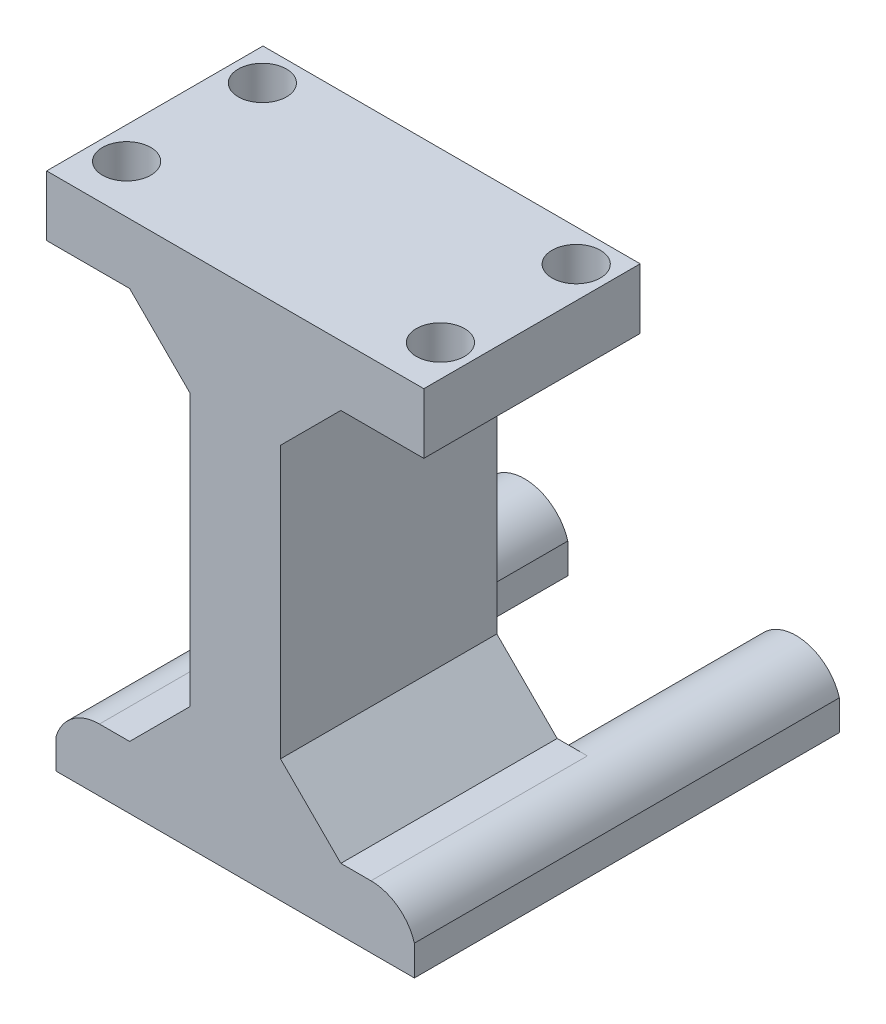
ISO-10303-21;
HEADER;
FILE_DESCRIPTION(('STEP AP214'),'2;1');
FILE_NAME('part.step','',(''),(''),'','','');
FILE_SCHEMA(('AUTOMOTIVE_DESIGN { 1 0 10303 214 1 1 1 1 }'));
ENDSEC;
DATA;
#1=APPLICATION_CONTEXT('core data for automotive mechanical design processes');
#2=APPLICATION_PROTOCOL_DEFINITION('international standard','automotive_design',2000,#1);
#3=PRODUCT_CONTEXT('',#1,'mechanical');
#4=PRODUCT('Part','Part','',(#3));
#5=PRODUCT_RELATED_PRODUCT_CATEGORY('part','',(#4));
#6=PRODUCT_DEFINITION_FORMATION('','',#4);
#7=PRODUCT_DEFINITION_CONTEXT('part definition',#1,'design');
#8=PRODUCT_DEFINITION('design','',#6,#7);
#9=PRODUCT_DEFINITION_SHAPE('','',#8);
#10=(LENGTH_UNIT() NAMED_UNIT(*) SI_UNIT(.MILLI.,.METRE.));
#11=(NAMED_UNIT(*) PLANE_ANGLE_UNIT() SI_UNIT($,.RADIAN.));
#12=(NAMED_UNIT(*) SI_UNIT($,.STERADIAN.) SOLID_ANGLE_UNIT());
#13=UNCERTAINTY_MEASURE_WITH_UNIT(LENGTH_MEASURE(1.E-05),#10,'distance_accuracy_value','');
#14=(GEOMETRIC_REPRESENTATION_CONTEXT(3) GLOBAL_UNCERTAINTY_ASSIGNED_CONTEXT((#13)) GLOBAL_UNIT_ASSIGNED_CONTEXT((#10,
#11,#12)) REPRESENTATION_CONTEXT('',''));
#15=CARTESIAN_POINT('',(0.,0.,0.));
#16=DIRECTION('',(0.,0.,1.));
#17=DIRECTION('',(1.,0.,0.));
#18=AXIS2_PLACEMENT_3D('',#15,#16,#17);
#19=CARTESIAN_POINT('',(0.,15.,-35.85));
#20=DIRECTION('',(0.,1.,0.));
#21=DIRECTION('',(0.,0.,1.));
#22=AXIS2_PLACEMENT_3D('',#19,#20,#21);
#23=PLANE('',#22);
#24=DIRECTION('',(-1.,0.,0.));
#25=VECTOR('',#24,1.);
#26=CARTESIAN_POINT('',(0.,15.,35.85));
#27=LINE('',#26,#25);
#28=CARTESIAN_POINT('',(10.0000000000001,15.,35.85));
#29=VERTEX_POINT('',#28);
#30=CARTESIAN_POINT('',(0.,15.,35.85));
#31=VERTEX_POINT('',#30);
#32=EDGE_CURVE('E318',#29,#31,#27,.T.);
#33=ORIENTED_EDGE('',*,*,#32,.F.);
#34=DIRECTION('',(0.,0.,-1.));
#35=VECTOR('',#34,1.);
#36=CARTESIAN_POINT('',(10.0000000000001,15.,-35.85));
#37=LINE('',#36,#35);
#38=CARTESIAN_POINT('',(10.0000000000001,15.,-35.85));
#39=VERTEX_POINT('',#38);
#40=EDGE_CURVE('E400',#29,#39,#37,.T.);
#41=ORIENTED_EDGE('',*,*,#40,.T.);
#42=DIRECTION('',(-1.,0.,0.));
#43=VECTOR('',#42,1.);
#44=CARTESIAN_POINT('',(0.,15.,-35.85));
#45=LINE('',#44,#43);
#46=CARTESIAN_POINT('',(0.,15.,-35.85));
#47=VERTEX_POINT('',#46);
#48=EDGE_CURVE('E297',#39,#47,#45,.T.);
#49=ORIENTED_EDGE('',*,*,#48,.T.);
#50=DIRECTION('',(0.,0.,1.));
#51=VECTOR('',#50,1.);
#52=CARTESIAN_POINT('',(0.,15.,-35.85));
#53=LINE('',#52,#51);
#54=EDGE_CURVE('E325',#47,#31,#53,.T.);
#55=ORIENTED_EDGE('',*,*,#54,.T.);
#56=EDGE_LOOP('',(#33,#41,#49,#55));
#57=FACE_BOUND('',#56,.T.);
#58=ADVANCED_FACE('F43',(#57),#23,.T.);
#59=CARTESIAN_POINT('',(90.,15.,-35.85));
#60=VERTEX_POINT('',#59);
#61=CARTESIAN_POINT('',(79.9999999999999,15.,-35.85));
#62=VERTEX_POINT('',#61);
#63=EDGE_CURVE('E299',#60,#62,#45,.T.);
#64=ORIENTED_EDGE('',*,*,#63,.T.);
#65=DIRECTION('',(0.,0.,1.));
#66=VECTOR('',#65,1.);
#67=CARTESIAN_POINT('',(79.9999999999999,15.,-35.85));
#68=LINE('',#67,#66);
#69=CARTESIAN_POINT('',(79.9999999999999,15.,35.85));
#70=VERTEX_POINT('',#69);
#71=EDGE_CURVE('E60',#62,#70,#68,.T.);
#72=ORIENTED_EDGE('',*,*,#71,.T.);
#73=CARTESIAN_POINT('',(90.,15.,35.85));
#74=VERTEX_POINT('',#73);
#75=EDGE_CURVE('E319',#74,#70,#27,.T.);
#76=ORIENTED_EDGE('',*,*,#75,.F.);
#77=DIRECTION('',(0.,0.,1.));
#78=VECTOR('',#77,1.);
#79=CARTESIAN_POINT('',(90.,15.,-35.85));
#80=LINE('',#79,#78);
#81=EDGE_CURVE('E330',#60,#74,#80,.T.);
#82=ORIENTED_EDGE('',*,*,#81,.F.);
#83=EDGE_LOOP('',(#64,#72,#76,#82));
#84=FACE_BOUND('',#83,.T.);
#85=ADVANCED_FACE('F488',(#84),#23,.T.);
#86=CARTESIAN_POINT('',(0.,0.,-105.));
#87=DIRECTION('',(0.,0.,1.));
#88=DIRECTION('',(1.,0.,0.));
#89=AXIS2_PLACEMENT_3D('',#86,#87,#88);
#90=CYLINDRICAL_SURFACE('',#89,15.);
#91=DIRECTION('',(0.,0.,1.));
#92=VECTOR('',#91,1.);
#93=CARTESIAN_POINT('',(-14.3747227124986,4.28571428571428,-105.));
#94=LINE('',#93,#92);
#95=CARTESIAN_POINT('',(-14.3747227124986,4.28571428571428,-105.));
#96=VERTEX_POINT('',#95);
#97=CARTESIAN_POINT('',(-14.3747227124986,4.28571428571428,35.85));
#98=VERTEX_POINT('',#97);
#99=EDGE_CURVE('E366',#96,#98,#94,.T.);
#100=ORIENTED_EDGE('',*,*,#99,.T.);
#101=CARTESIAN_POINT('',(0.,0.,35.85));
#102=DIRECTION('',(0.,0.,1.));
#103=DIRECTION('',(1.,0.,0.));
#104=AXIS2_PLACEMENT_3D('',#101,#102,#103);
#105=CIRCLE('',#104,15.);
#106=EDGE_CURVE('E298',#31,#98,#105,.T.);
#107=ORIENTED_EDGE('',*,*,#106,.F.);
#108=ORIENTED_EDGE('',*,*,#54,.F.);
#109=CARTESIAN_POINT('',(0.,0.,-35.85));
#110=DIRECTION('',(0.,0.,1.));
#111=DIRECTION('',(1.,0.,0.));
#112=AXIS2_PLACEMENT_3D('',#109,#110,#111);
#113=CIRCLE('',#112,15.);
#114=CARTESIAN_POINT('',(14.3747227124986,4.28571428571428,-35.85));
#115=VERTEX_POINT('',#114);
#116=EDGE_CURVE('E341',#47,#115,#113,.F.);
#117=ORIENTED_EDGE('',*,*,#116,.T.);
#118=DIRECTION('',(0.,0.,1.));
#119=VECTOR('',#118,1.);
#120=CARTESIAN_POINT('',(14.3747227124986,4.28571428571428,-105.));
#121=LINE('',#120,#119);
#122=CARTESIAN_POINT('',(14.3747227124986,4.28571428571428,-105.));
#123=VERTEX_POINT('',#122);
#124=EDGE_CURVE('E365',#123,#115,#121,.T.);
#125=ORIENTED_EDGE('',*,*,#124,.F.);
#126=CARTESIAN_POINT('',(0.,0.,-105.));
#127=DIRECTION('',(0.,0.,1.));
#128=DIRECTION('',(1.,0.,0.));
#129=AXIS2_PLACEMENT_3D('',#126,#127,#128);
#130=CIRCLE('',#129,15.);
#131=EDGE_CURVE('E361',#123,#96,#130,.T.);
#132=ORIENTED_EDGE('',*,*,#131,.T.);
#133=EDGE_LOOP('',(#100,#107,#108,#117,#125,#132));
#134=FACE_BOUND('',#133,.T.);
#135=ADVANCED_FACE('F435',(#134),#90,.T.);
#136=CARTESIAN_POINT('',(14.3747227124986,-5.71428571428572,-105.));
#137=DIRECTION('',(-1.,0.,0.));
#138=DIRECTION('',(0.,0.,1.));
#139=AXIS2_PLACEMENT_3D('',#136,#137,#138);
#140=PLANE('',#139);
#141=DIRECTION('',(0.,1.,0.));
#142=VECTOR('',#141,1.);
#143=CARTESIAN_POINT('',(14.3747227124986,-5.71428571428572,-35.85));
#144=LINE('',#143,#142);
#145=CARTESIAN_POINT('',(14.3747227124986,-5.71428571428572,-35.85));
#146=VERTEX_POINT('',#145);
#147=EDGE_CURVE('E329',#146,#115,#144,.T.);
#148=ORIENTED_EDGE('',*,*,#147,.F.);
#149=DIRECTION('',(0.,0.,1.));
#150=VECTOR('',#149,1.);
#151=CARTESIAN_POINT('',(14.3747227124986,-5.71428571428572,-105.));
#152=LINE('',#151,#150);
#153=CARTESIAN_POINT('',(14.3747227124986,-5.71428571428572,-105.));
#154=VERTEX_POINT('',#153);
#155=EDGE_CURVE('E351',#154,#146,#152,.T.);
#156=ORIENTED_EDGE('',*,*,#155,.F.);
#157=DIRECTION('',(0.,1.,0.));
#158=VECTOR('',#157,1.);
#159=CARTESIAN_POINT('',(14.3747227124986,-5.71428571428572,-105.));
#160=LINE('',#159,#158);
#161=EDGE_CURVE('E355',#154,#123,#160,.T.);
#162=ORIENTED_EDGE('',*,*,#161,.T.);
#163=ORIENTED_EDGE('',*,*,#124,.T.);
#164=EDGE_LOOP('',(#148,#156,#162,#163));
#165=FACE_BOUND('',#164,.T.);
#166=ADVANCED_FACE('F502',(#165),#140,.F.);
#167=CARTESIAN_POINT('',(0.,0.,-105.));
#168=DIRECTION('',(0.,0.,1.));
#169=DIRECTION('',(1.,0.,0.));
#170=AXIS2_PLACEMENT_3D('',#167,#168,#169);
#171=PLANE('',#170);
#172=ORIENTED_EDGE('',*,*,#131,.F.);
#173=ORIENTED_EDGE('',*,*,#161,.F.);
#174=DIRECTION('',(1.,0.,0.));
#175=VECTOR('',#174,1.);
#176=CARTESIAN_POINT('',(-14.3747227124986,-5.71428571428572,-105.));
#177=LINE('',#176,#175);
#178=CARTESIAN_POINT('',(-14.3747227124986,-5.71428571428572,-105.));
#179=VERTEX_POINT('',#178);
#180=EDGE_CURVE('E348',#179,#154,#177,.T.);
#181=ORIENTED_EDGE('',*,*,#180,.F.);
#182=DIRECTION('',(0.,1.,0.));
#183=VECTOR('',#182,1.);
#184=CARTESIAN_POINT('',(-14.3747227124986,-5.71428571428572,-105.));
#185=LINE('',#184,#183);
#186=EDGE_CURVE('E358',#179,#96,#185,.T.);
#187=ORIENTED_EDGE('',*,*,#186,.T.);
#188=EDGE_LOOP('',(#172,#173,#181,#187));
#189=FACE_BOUND('',#188,.T.);
#190=ADVANCED_FACE('F505',(#189),#171,.F.);
#191=CARTESIAN_POINT('',(-14.3747227124986,-5.71428571428572,-105.));
#192=DIRECTION('',(1.,0.,0.));
#193=DIRECTION('',(0.,0.,-1.));
#194=AXIS2_PLACEMENT_3D('',#191,#192,#193);
#195=PLANE('',#194);
#196=DIRECTION('',(0.,-1.,0.));
#197=VECTOR('',#196,1.);
#198=CARTESIAN_POINT('',(-14.3747227124986,-5.71428571428572,35.85));
#199=LINE('',#198,#197);
#200=CARTESIAN_POINT('',(-14.3747227124986,-5.71428571428572,35.85));
#201=VERTEX_POINT('',#200);
#202=EDGE_CURVE('E292',#98,#201,#199,.T.);
#203=ORIENTED_EDGE('',*,*,#202,.F.);
#204=ORIENTED_EDGE('',*,*,#99,.F.);
#205=ORIENTED_EDGE('',*,*,#186,.F.);
#206=DIRECTION('',(0.,0.,-1.));
#207=VECTOR('',#206,1.);
#208=CARTESIAN_POINT('',(-14.3747227124986,-5.71428571428572,-105.));
#209=LINE('',#208,#207);
#210=EDGE_CURVE('E345',#201,#179,#209,.T.);
#211=ORIENTED_EDGE('',*,*,#210,.F.);
#212=EDGE_LOOP('',(#203,#204,#205,#211));
#213=FACE_BOUND('',#212,.T.);
#214=ADVANCED_FACE('F442',(#213),#195,.F.);
#215=CARTESIAN_POINT('',(0.,-5.71428571428572,0.));
#216=DIRECTION('',(0.,1.,0.));
#217=DIRECTION('',(0.,0.,1.));
#218=AXIS2_PLACEMENT_3D('',#215,#216,#217);
#219=PLANE('',#218);
#220=DIRECTION('',(0.,0.,1.));
#221=VECTOR('',#220,1.);
#222=CARTESIAN_POINT('',(104.374722712499,-5.71428571428572,-35.85));
#223=LINE('',#222,#221);
#224=CARTESIAN_POINT('',(104.374722712499,-5.71428571428572,-105.));
#225=VERTEX_POINT('',#224);
#226=CARTESIAN_POINT('',(104.374722712499,-5.71428571428572,35.85));
#227=VERTEX_POINT('',#226);
#228=EDGE_CURVE('E302',#225,#227,#223,.T.);
#229=ORIENTED_EDGE('',*,*,#228,.T.);
#230=DIRECTION('',(1.,0.,0.));
#231=VECTOR('',#230,1.);
#232=CARTESIAN_POINT('',(-14.3747227124986,-5.71428571428572,35.85));
#233=LINE('',#232,#231);
#234=EDGE_CURVE('E306',#201,#227,#233,.T.);
#235=ORIENTED_EDGE('',*,*,#234,.F.);
#236=ORIENTED_EDGE('',*,*,#210,.T.);
#237=ORIENTED_EDGE('',*,*,#180,.T.);
#238=ORIENTED_EDGE('',*,*,#155,.T.);
#239=DIRECTION('',(1.,0.,0.));
#240=VECTOR('',#239,1.);
#241=CARTESIAN_POINT('',(-14.3747227124986,-5.71428571428572,-35.85));
#242=LINE('',#241,#240);
#243=CARTESIAN_POINT('',(75.6252772875013,-5.71428571428572,-35.85));
#244=VERTEX_POINT('',#243);
#245=EDGE_CURVE('E293',#146,#244,#242,.T.);
#246=ORIENTED_EDGE('',*,*,#245,.T.);
#247=DIRECTION('',(0.,0.,-1.));
#248=VECTOR('',#247,1.);
#249=CARTESIAN_POINT('',(75.6252772875013,-5.71428571428572,-105.));
#250=LINE('',#249,#248);
#251=CARTESIAN_POINT('',(75.6252772875013,-5.71428571428572,-105.));
#252=VERTEX_POINT('',#251);
#253=EDGE_CURVE('E270',#244,#252,#250,.T.);
#254=ORIENTED_EDGE('',*,*,#253,.T.);
#255=DIRECTION('',(1.,0.,0.));
#256=VECTOR('',#255,1.);
#257=CARTESIAN_POINT('',(75.6252772875013,-5.71428571428572,-105.));
#258=LINE('',#257,#256);
#259=EDGE_CURVE('E273',#252,#225,#258,.T.);
#260=ORIENTED_EDGE('',*,*,#259,.T.);
#261=EDGE_LOOP('',(#229,#235,#236,#237,#238,#246,#254,#260));
#262=FACE_BOUND('',#261,.T.);
#263=ADVANCED_FACE('F446',(#262),#219,.F.);
#264=CARTESIAN_POINT('',(90.,0.,-35.85));
#265=DIRECTION('',(0.,0.,1.));
#266=DIRECTION('',(1.,0.,0.));
#267=AXIS2_PLACEMENT_3D('',#264,#265,#266);
#268=CYLINDRICAL_SURFACE('',#267,15.);
#269=CARTESIAN_POINT('',(90.,0.,35.85));
#270=DIRECTION('',(0.,0.,1.));
#271=DIRECTION('',(1.,0.,0.));
#272=AXIS2_PLACEMENT_3D('',#269,#270,#271);
#273=CIRCLE('',#272,15.);
#274=CARTESIAN_POINT('',(104.374722712499,4.28571428571428,35.85));
#275=VERTEX_POINT('',#274);
#276=EDGE_CURVE('E314',#275,#74,#273,.T.);
#277=ORIENTED_EDGE('',*,*,#276,.F.);
#278=DIRECTION('',(0.,0.,1.));
#279=VECTOR('',#278,1.);
#280=CARTESIAN_POINT('',(104.374722712499,4.28571428571428,-35.85));
#281=LINE('',#280,#279);
#282=CARTESIAN_POINT('',(104.374722712499,4.28571428571428,-105.));
#283=VERTEX_POINT('',#282);
#284=EDGE_CURVE('E333',#283,#275,#281,.T.);
#285=ORIENTED_EDGE('',*,*,#284,.F.);
#286=CARTESIAN_POINT('',(90.,0.,-105.));
#287=DIRECTION('',(0.,0.,1.));
#288=DIRECTION('',(1.,0.,0.));
#289=AXIS2_PLACEMENT_3D('',#286,#287,#288);
#290=CIRCLE('',#289,15.);
#291=CARTESIAN_POINT('',(75.6252772875013,4.28571428571428,-105.));
#292=VERTEX_POINT('',#291);
#293=EDGE_CURVE('E284',#283,#292,#290,.T.);
#294=ORIENTED_EDGE('',*,*,#293,.T.);
#295=DIRECTION('',(0.,0.,1.));
#296=VECTOR('',#295,1.);
#297=CARTESIAN_POINT('',(75.6252772875013,4.28571428571428,-105.));
#298=LINE('',#297,#296);
#299=CARTESIAN_POINT('',(75.6252772875013,4.28571428571428,-35.85));
#300=VERTEX_POINT('',#299);
#301=EDGE_CURVE('E288',#292,#300,#298,.T.);
#302=ORIENTED_EDGE('',*,*,#301,.T.);
#303=CARTESIAN_POINT('',(90.,0.,-35.85));
#304=DIRECTION('',(0.,0.,1.));
#305=DIRECTION('',(1.,0.,0.));
#306=AXIS2_PLACEMENT_3D('',#303,#304,#305);
#307=CIRCLE('',#306,15.);
#308=EDGE_CURVE('E374',#60,#300,#307,.T.);
#309=ORIENTED_EDGE('',*,*,#308,.F.);
#310=ORIENTED_EDGE('',*,*,#81,.T.);
#311=EDGE_LOOP('',(#277,#285,#294,#302,#309,#310));
#312=FACE_BOUND('',#311,.T.);
#313=ADVANCED_FACE('F455',(#312),#268,.T.);
#314=CARTESIAN_POINT('',(104.374722712499,-5.71428571428572,-35.85));
#315=DIRECTION('',(1.,0.,0.));
#316=DIRECTION('',(0.,0.,-1.));
#317=AXIS2_PLACEMENT_3D('',#314,#315,#316);
#318=PLANE('',#317);
#319=DIRECTION('',(0.,1.,0.));
#320=VECTOR('',#319,1.);
#321=CARTESIAN_POINT('',(104.374722712499,-5.71428571428572,35.85));
#322=LINE('',#321,#320);
#323=EDGE_CURVE('E310',#227,#275,#322,.T.);
#324=ORIENTED_EDGE('',*,*,#323,.F.);
#325=ORIENTED_EDGE('',*,*,#228,.F.);
#326=DIRECTION('',(0.,1.,0.));
#327=VECTOR('',#326,1.);
#328=CARTESIAN_POINT('',(104.374722712499,-5.71428571428572,-105.));
#329=LINE('',#328,#327);
#330=EDGE_CURVE('E277',#225,#283,#329,.T.);
#331=ORIENTED_EDGE('',*,*,#330,.T.);
#332=ORIENTED_EDGE('',*,*,#284,.T.);
#333=EDGE_LOOP('',(#324,#325,#331,#332));
#334=FACE_BOUND('',#333,.T.);
#335=ADVANCED_FACE('F451',(#334),#318,.T.);
#336=CARTESIAN_POINT('',(0.,0.,-35.85));
#337=DIRECTION('',(0.,0.,1.));
#338=DIRECTION('',(1.,0.,0.));
#339=AXIS2_PLACEMENT_3D('',#336,#337,#338);
#340=PLANE('',#339);
#341=ORIENTED_EDGE('',*,*,#63,.F.);
#342=ORIENTED_EDGE('',*,*,#308,.T.);
#343=DIRECTION('',(0.,1.,0.));
#344=VECTOR('',#343,1.);
#345=CARTESIAN_POINT('',(75.6252772875013,0.,-35.85));
#346=LINE('',#345,#344);
#347=EDGE_CURVE('E369',#244,#300,#346,.T.);
#348=ORIENTED_EDGE('',*,*,#347,.F.);
#349=ORIENTED_EDGE('',*,*,#245,.F.);
#350=ORIENTED_EDGE('',*,*,#147,.T.);
#351=ORIENTED_EDGE('',*,*,#116,.F.);
#352=ORIENTED_EDGE('',*,*,#48,.F.);
#353=DIRECTION('',(0.707106781186544,0.707106781186551,0.));
#354=VECTOR('',#353,1.);
#355=CARTESIAN_POINT('',(-2.49999999999991,2.49999999999988,-35.85));
#356=LINE('',#355,#354);
#357=CARTESIAN_POINT('',(30.,35.0000000000002,-35.85));
#358=VERTEX_POINT('',#357);
#359=EDGE_CURVE('E420',#39,#358,#356,.T.);
#360=ORIENTED_EDGE('',*,*,#359,.T.);
#361=DIRECTION('',(0.,-1.,0.));
#362=VECTOR('',#361,1.);
#363=CARTESIAN_POINT('',(30.,145.,-35.85));
#364=LINE('',#363,#362);
#365=CARTESIAN_POINT('',(30.,125.,-35.85));
#366=VERTEX_POINT('',#365);
#367=EDGE_CURVE('E250',#366,#358,#364,.T.);
#368=ORIENTED_EDGE('',*,*,#367,.F.);
#369=DIRECTION('',(-0.707106781186551,0.707106781186544,0.));
#370=VECTOR('',#369,1.);
#371=CARTESIAN_POINT('',(77.4999999999999,77.5000000000007,-35.85));
#372=LINE('',#371,#370);
#373=CARTESIAN_POINT('',(9.99999999999987,145.,-35.8500000000005));
#374=VERTEX_POINT('',#373);
#375=EDGE_CURVE('E414',#366,#374,#372,.T.);
#376=ORIENTED_EDGE('',*,*,#375,.T.);
#377=DIRECTION('',(1.,0.,0.));
#378=VECTOR('',#377,1.);
#379=CARTESIAN_POINT('',(-17.5073593128807,145.,-35.8500000000007));
#380=LINE('',#379,#378);
#381=CARTESIAN_POINT('',(-17.5073593128807,145.,-35.8500000000007));
#382=VERTEX_POINT('',#381);
#383=EDGE_CURVE('E199',#382,#374,#380,.T.);
#384=ORIENTED_EDGE('',*,*,#383,.F.);
#385=DIRECTION('',(0.,-1.,0.));
#386=VECTOR('',#385,1.);
#387=CARTESIAN_POINT('',(-17.5073593128807,165.,-35.8500000000007));
#388=LINE('',#387,#386);
#389=CARTESIAN_POINT('',(-17.5073593128807,165.,-35.8500000000007));
#390=VERTEX_POINT('',#389);
#391=EDGE_CURVE('E193',#390,#382,#388,.T.);
#392=ORIENTED_EDGE('',*,*,#391,.F.);
#393=DIRECTION('',(1.,0.,0.));
#394=VECTOR('',#393,1.);
#395=CARTESIAN_POINT('',(-17.5073593128807,165.,-35.8500000000007));
#396=LINE('',#395,#394);
#397=CARTESIAN_POINT('',(107.507359312881,165.,-35.8499999999998));
#398=VERTEX_POINT('',#397);
#399=EDGE_CURVE('E197',#390,#398,#396,.T.);
#400=ORIENTED_EDGE('',*,*,#399,.T.);
#401=DIRECTION('',(0.,-1.,0.));
#402=VECTOR('',#401,1.);
#403=CARTESIAN_POINT('',(107.507359312881,165.,-35.8499999999998));
#404=LINE('',#403,#402);
#405=CARTESIAN_POINT('',(107.507359312881,145.,-35.8499999999998));
#406=VERTEX_POINT('',#405);
#407=EDGE_CURVE('E205',#398,#406,#404,.T.);
#408=ORIENTED_EDGE('',*,*,#407,.T.);
#409=CARTESIAN_POINT('',(80.0000000000002,145.,-35.85));
#410=VERTEX_POINT('',#409);
#411=EDGE_CURVE('E240',#410,#406,#380,.T.);
#412=ORIENTED_EDGE('',*,*,#411,.F.);
#413=DIRECTION('',(-0.707106781186552,-0.707106781186543,0.));
#414=VECTOR('',#413,1.);
#415=CARTESIAN_POINT('',(-32.5000000000004,32.5000000000008,-35.85));
#416=LINE('',#415,#414);
#417=CARTESIAN_POINT('',(60.,125.,-35.85));
#418=VERTEX_POINT('',#417);
#419=EDGE_CURVE('E405',#410,#418,#416,.T.);
#420=ORIENTED_EDGE('',*,*,#419,.T.);
#421=DIRECTION('',(0.,-1.,0.));
#422=VECTOR('',#421,1.);
#423=CARTESIAN_POINT('',(60.,145.,-35.85));
#424=LINE('',#423,#422);
#425=CARTESIAN_POINT('',(60.,35.0000000000002,-35.85));
#426=VERTEX_POINT('',#425);
#427=EDGE_CURVE('E259',#418,#426,#424,.T.);
#428=ORIENTED_EDGE('',*,*,#427,.T.);
#429=DIRECTION('',(0.707106781186544,-0.707106781186551,0.));
#430=VECTOR('',#429,1.);
#431=CARTESIAN_POINT('',(47.5000000000004,47.4999999999999,-35.85));
#432=LINE('',#431,#430);
#433=EDGE_CURVE('E53',#426,#62,#432,.T.);
#434=ORIENTED_EDGE('',*,*,#433,.T.);
#435=EDGE_LOOP('',(#341,#342,#348,#349,#350,#351,#352,#360,#368,#376,#384,#392,#400,#408,#412,
#420,#428,#434));
#436=FACE_BOUND('',#435,.T.);
#437=ADVANCED_FACE('F195',(#436),#340,.F.);
#438=CARTESIAN_POINT('',(0.,0.,35.85));
#439=DIRECTION('',(0.,0.,1.));
#440=DIRECTION('',(1.,0.,0.));
#441=AXIS2_PLACEMENT_3D('',#438,#439,#440);
#442=PLANE('',#441);
#443=ORIENTED_EDGE('',*,*,#202,.T.);
#444=ORIENTED_EDGE('',*,*,#234,.T.);
#445=ORIENTED_EDGE('',*,*,#323,.T.);
#446=ORIENTED_EDGE('',*,*,#276,.T.);
#447=ORIENTED_EDGE('',*,*,#75,.T.);
#448=DIRECTION('',(-0.707106781186544,0.707106781186551,0.));
#449=VECTOR('',#448,1.);
#450=CARTESIAN_POINT('',(60.,35.0000000000002,35.85));
#451=LINE('',#450,#449);
#452=CARTESIAN_POINT('',(60.,35.0000000000002,35.85));
#453=VERTEX_POINT('',#452);
#454=EDGE_CURVE('E11',#70,#453,#451,.T.);
#455=ORIENTED_EDGE('',*,*,#454,.T.);
#456=DIRECTION('',(0.,-1.,0.));
#457=VECTOR('',#456,1.);
#458=CARTESIAN_POINT('',(60.,145.,35.85));
#459=LINE('',#458,#457);
#460=CARTESIAN_POINT('',(60.,125.,35.85));
#461=VERTEX_POINT('',#460);
#462=EDGE_CURVE('E262',#461,#453,#459,.T.);
#463=ORIENTED_EDGE('',*,*,#462,.F.);
#464=DIRECTION('',(0.707106781186552,0.707106781186543,0.));
#465=VECTOR('',#464,1.);
#466=CARTESIAN_POINT('',(80.0000000000002,145.,35.85));
#467=LINE('',#466,#465);
#468=CARTESIAN_POINT('',(80.0000000000002,145.,35.8499999999999));
#469=VERTEX_POINT('',#468);
#470=EDGE_CURVE('E408',#461,#469,#467,.T.);
#471=ORIENTED_EDGE('',*,*,#470,.T.);
#472=DIRECTION('',(-1.,0.,0.));
#473=VECTOR('',#472,1.);
#474=CARTESIAN_POINT('',(107.507359312881,145.,35.8500000000001));
#475=LINE('',#474,#473);
#476=CARTESIAN_POINT('',(107.507359312881,145.,35.8500000000001));
#477=VERTEX_POINT('',#476);
#478=EDGE_CURVE('E223',#477,#469,#475,.T.);
#479=ORIENTED_EDGE('',*,*,#478,.F.);
#480=DIRECTION('',(0.,-1.,0.));
#481=VECTOR('',#480,1.);
#482=CARTESIAN_POINT('',(107.507359312881,165.,35.8500000000001));
#483=LINE('',#482,#481);
#484=CARTESIAN_POINT('',(107.507359312881,165.,35.8500000000001));
#485=VERTEX_POINT('',#484);
#486=EDGE_CURVE('E251',#485,#477,#483,.T.);
#487=ORIENTED_EDGE('',*,*,#486,.F.);
#488=DIRECTION('',(-1.,0.,0.));
#489=VECTOR('',#488,1.);
#490=CARTESIAN_POINT('',(107.507359312881,165.,35.8500000000001));
#491=LINE('',#490,#489);
#492=CARTESIAN_POINT('',(-17.5073593128815,165.,35.8499999999993));
#493=VERTEX_POINT('',#492);
#494=EDGE_CURVE('E206',#485,#493,#491,.T.);
#495=ORIENTED_EDGE('',*,*,#494,.T.);
#496=DIRECTION('',(0.,-1.,0.));
#497=VECTOR('',#496,1.);
#498=CARTESIAN_POINT('',(-17.5073593128815,165.,35.8499999999993));
#499=LINE('',#498,#497);
#500=CARTESIAN_POINT('',(-17.5073593128815,145.,35.8499999999993));
#501=VERTEX_POINT('',#500);
#502=EDGE_CURVE('E221',#493,#501,#499,.T.);
#503=ORIENTED_EDGE('',*,*,#502,.T.);
#504=CARTESIAN_POINT('',(9.99999999999987,145.,35.8499999999995));
#505=VERTEX_POINT('',#504);
#506=EDGE_CURVE('E227',#505,#501,#475,.T.);
#507=ORIENTED_EDGE('',*,*,#506,.F.);
#508=DIRECTION('',(0.707106781186551,-0.707106781186544,0.));
#509=VECTOR('',#508,1.);
#510=CARTESIAN_POINT('',(9.99999999999987,145.,35.85));
#511=LINE('',#510,#509);
#512=CARTESIAN_POINT('',(30.,125.,35.85));
#513=VERTEX_POINT('',#512);
#514=EDGE_CURVE('E411',#505,#513,#511,.T.);
#515=ORIENTED_EDGE('',*,*,#514,.T.);
#516=DIRECTION('',(0.,-1.,0.));
#517=VECTOR('',#516,1.);
#518=CARTESIAN_POINT('',(30.,145.,35.85));
#519=LINE('',#518,#517);
#520=CARTESIAN_POINT('',(30.,35.0000000000002,35.85));
#521=VERTEX_POINT('',#520);
#522=EDGE_CURVE('E266',#513,#521,#519,.T.);
#523=ORIENTED_EDGE('',*,*,#522,.T.);
#524=DIRECTION('',(-0.707106781186544,-0.707106781186551,0.));
#525=VECTOR('',#524,1.);
#526=CARTESIAN_POINT('',(30.,35.0000000000002,35.85));
#527=LINE('',#526,#525);
#528=EDGE_CURVE('E417',#521,#29,#527,.T.);
#529=ORIENTED_EDGE('',*,*,#528,.T.);
#530=ORIENTED_EDGE('',*,*,#32,.T.);
#531=ORIENTED_EDGE('',*,*,#106,.T.);
#532=EDGE_LOOP('',(#443,#444,#445,#446,#447,#455,#463,#471,#479,#487,#495,#503,#507,#515,#523,
#529,#530,#531));
#533=FACE_BOUND('',#532,.T.);
#534=ADVANCED_FACE('F427',(#533),#442,.T.);
#535=CARTESIAN_POINT('',(75.6252772875013,-5.71428571428572,-105.));
#536=DIRECTION('',(1.,0.,0.));
#537=DIRECTION('',(0.,0.,-1.));
#538=AXIS2_PLACEMENT_3D('',#535,#536,#537);
#539=PLANE('',#538);
#540=ORIENTED_EDGE('',*,*,#253,.F.);
#541=ORIENTED_EDGE('',*,*,#347,.T.);
#542=ORIENTED_EDGE('',*,*,#301,.F.);
#543=DIRECTION('',(0.,1.,0.));
#544=VECTOR('',#543,1.);
#545=CARTESIAN_POINT('',(75.6252772875013,-5.71428571428572,-105.));
#546=LINE('',#545,#544);
#547=EDGE_CURVE('E281',#252,#292,#546,.T.);
#548=ORIENTED_EDGE('',*,*,#547,.F.);
#549=EDGE_LOOP('',(#540,#541,#542,#548));
#550=FACE_BOUND('',#549,.T.);
#551=ADVANCED_FACE('F692',(#550),#539,.F.);
#552=CARTESIAN_POINT('',(0.,0.,-105.));
#553=DIRECTION('',(0.,0.,1.));
#554=DIRECTION('',(1.,0.,0.));
#555=AXIS2_PLACEMENT_3D('',#552,#553,#554);
#556=PLANE('',#555);
#557=ORIENTED_EDGE('',*,*,#293,.F.);
#558=ORIENTED_EDGE('',*,*,#330,.F.);
#559=ORIENTED_EDGE('',*,*,#259,.F.);
#560=ORIENTED_EDGE('',*,*,#547,.T.);
#561=EDGE_LOOP('',(#557,#558,#559,#560));
#562=FACE_BOUND('',#561,.T.);
#563=ADVANCED_FACE('F687',(#562),#556,.F.);
#564=CARTESIAN_POINT('',(30.,145.,35.85));
#565=DIRECTION('',(1.,0.,0.));
#566=DIRECTION('',(0.,0.,-1.));
#567=AXIS2_PLACEMENT_3D('',#564,#565,#566);
#568=PLANE('',#567);
#569=ORIENTED_EDGE('',*,*,#522,.F.);
#570=DIRECTION('',(0.,0.,-1.));
#571=VECTOR('',#570,1.);
#572=CARTESIAN_POINT('',(30.,125.,35.85));
#573=LINE('',#572,#571);
#574=EDGE_CURVE('E397',#513,#366,#573,.T.);
#575=ORIENTED_EDGE('',*,*,#574,.T.);
#576=ORIENTED_EDGE('',*,*,#367,.T.);
#577=DIRECTION('',(0.,0.,1.));
#578=VECTOR('',#577,1.);
#579=CARTESIAN_POINT('',(30.,35.0000000000002,35.85));
#580=LINE('',#579,#578);
#581=EDGE_CURVE('E393',#358,#521,#580,.T.);
#582=ORIENTED_EDGE('',*,*,#581,.T.);
#583=EDGE_LOOP('',(#569,#575,#576,#582));
#584=FACE_BOUND('',#583,.T.);
#585=ADVANCED_FACE('F541',(#584),#568,.F.);
#586=CARTESIAN_POINT('',(60.,145.,35.85));
#587=DIRECTION('',(-1.,0.,0.));
#588=DIRECTION('',(0.,0.,1.));
#589=AXIS2_PLACEMENT_3D('',#586,#587,#588);
#590=PLANE('',#589);
#591=ORIENTED_EDGE('',*,*,#427,.F.);
#592=DIRECTION('',(0.,0.,1.));
#593=VECTOR('',#592,1.);
#594=CARTESIAN_POINT('',(60.,125.,35.85));
#595=LINE('',#594,#593);
#596=EDGE_CURVE('E386',#418,#461,#595,.T.);
#597=ORIENTED_EDGE('',*,*,#596,.T.);
#598=ORIENTED_EDGE('',*,*,#462,.T.);
#599=DIRECTION('',(0.,0.,-1.));
#600=VECTOR('',#599,1.);
#601=CARTESIAN_POINT('',(60.,35.0000000000002,35.85));
#602=LINE('',#601,#600);
#603=EDGE_CURVE('E382',#453,#426,#602,.T.);
#604=ORIENTED_EDGE('',*,*,#603,.T.);
#605=EDGE_LOOP('',(#591,#597,#598,#604));
#606=FACE_BOUND('',#605,.T.);
#607=ADVANCED_FACE('F463',(#606),#590,.F.);
#608=CARTESIAN_POINT('',(0.,145.,0.));
#609=DIRECTION('',(0.,-1.,0.));
#610=DIRECTION('',(0.,0.,-1.));
#611=AXIS2_PLACEMENT_3D('',#608,#609,#610);
#612=PLANE('',#611);
#613=CARTESIAN_POINT('',(-6.99999999999987,145.,-25.1500000000006));
#614=DIRECTION('',(0.,-1.,0.));
#615=DIRECTION('',(0.,0.,-1.));
#616=AXIS2_PLACEMENT_3D('',#613,#614,#615);
#617=CIRCLE('',#616,8.00000000000001);
#618=CARTESIAN_POINT('',(-6.99999999999987,145.,-33.1500000000007));
#619=VERTEX_POINT('',#618);
#620=EDGE_CURVE('E564',#619,#619,#617,.T.);
#621=ORIENTED_EDGE('',*,*,#620,.F.);
#622=EDGE_LOOP('',(#621));
#623=FACE_BOUND('',#622,.T.);
#624=CARTESIAN_POINT('',(-7.00000000000037,145.,19.8499999999995));
#625=DIRECTION('',(0.,-1.,0.));
#626=DIRECTION('',(0.,0.,-1.));
#627=AXIS2_PLACEMENT_3D('',#624,#625,#626);
#628=CIRCLE('',#627,7.99999999999997);
#629=CARTESIAN_POINT('',(-7.00000000000037,145.,11.8499999999995));
#630=VERTEX_POINT('',#629);
#631=EDGE_CURVE('E572',#630,#630,#628,.T.);
#632=ORIENTED_EDGE('',*,*,#631,.F.);
#633=EDGE_LOOP('',(#632));
#634=FACE_BOUND('',#633,.T.);
#635=ORIENTED_EDGE('',*,*,#383,.T.);
#636=DIRECTION('',(0.,0.,1.));
#637=VECTOR('',#636,1.);
#638=CARTESIAN_POINT('',(9.99999999999987,145.,0.));
#639=LINE('',#638,#637);
#640=EDGE_CURVE('E389',#374,#505,#639,.T.);
#641=ORIENTED_EDGE('',*,*,#640,.T.);
#642=ORIENTED_EDGE('',*,*,#506,.T.);
#643=DIRECTION('',(0.,0.,-1.));
#644=VECTOR('',#643,1.);
#645=CARTESIAN_POINT('',(-17.5073593128815,145.,35.8499999999993));
#646=LINE('',#645,#644);
#647=EDGE_CURVE('E237',#501,#382,#646,.T.);
#648=ORIENTED_EDGE('',*,*,#647,.T.);
#649=EDGE_LOOP('',(#635,#641,#642,#648));
#650=FACE_BOUND('',#649,.T.);
#651=ADVANCED_FACE('F484',(#623,#634,#650),#612,.T.);
#652=CARTESIAN_POINT('',(-17.5073593128815,165.,35.8499999999993));
#653=DIRECTION('',(-1.,0.,0.));
#654=DIRECTION('',(0.,0.,1.));
#655=AXIS2_PLACEMENT_3D('',#652,#653,#654);
#656=PLANE('',#655);
#657=ORIENTED_EDGE('',*,*,#647,.F.);
#658=ORIENTED_EDGE('',*,*,#502,.F.);
#659=DIRECTION('',(0.,0.,-1.));
#660=VECTOR('',#659,1.);
#661=CARTESIAN_POINT('',(-17.5073593128815,165.,35.8499999999993));
#662=LINE('',#661,#660);
#663=EDGE_CURVE('E213',#493,#390,#662,.T.);
#664=ORIENTED_EDGE('',*,*,#663,.T.);
#665=ORIENTED_EDGE('',*,*,#391,.T.);
#666=EDGE_LOOP('',(#657,#658,#664,#665));
#667=FACE_BOUND('',#666,.T.);
#668=ADVANCED_FACE('F219',(#667),#656,.T.);
#669=CARTESIAN_POINT('',(107.507359312881,165.,-35.8499999999998));
#670=DIRECTION('',(1.,0.,0.));
#671=DIRECTION('',(0.,0.,-1.));
#672=AXIS2_PLACEMENT_3D('',#669,#670,#671);
#673=PLANE('',#672);
#674=DIRECTION('',(0.,0.,1.));
#675=VECTOR('',#674,1.);
#676=CARTESIAN_POINT('',(107.507359312881,145.,-35.8499999999998));
#677=LINE('',#676,#675);
#678=EDGE_CURVE('E244',#406,#477,#677,.T.);
#679=ORIENTED_EDGE('',*,*,#678,.F.);
#680=ORIENTED_EDGE('',*,*,#407,.F.);
#681=DIRECTION('',(0.,0.,1.));
#682=VECTOR('',#681,1.);
#683=CARTESIAN_POINT('',(107.507359312881,165.,-35.8499999999998));
#684=LINE('',#683,#682);
#685=EDGE_CURVE('E216',#398,#485,#684,.T.);
#686=ORIENTED_EDGE('',*,*,#685,.T.);
#687=ORIENTED_EDGE('',*,*,#486,.T.);
#688=EDGE_LOOP('',(#679,#680,#686,#687));
#689=FACE_BOUND('',#688,.T.);
#690=ADVANCED_FACE('F475',(#689),#673,.T.);
#691=CARTESIAN_POINT('',(0.,165.,0.));
#692=DIRECTION('',(0.,-1.,0.));
#693=DIRECTION('',(0.,0.,-1.));
#694=AXIS2_PLACEMENT_3D('',#691,#692,#693);
#695=PLANE('',#694);
#696=CARTESIAN_POINT('',(-7.00000000000037,165.,19.8499999999994));
#697=DIRECTION('',(0.,-1.,0.));
#698=DIRECTION('',(0.,0.,-1.));
#699=AXIS2_PLACEMENT_3D('',#696,#697,#698);
#700=CIRCLE('',#699,7.99999999999997);
#701=CARTESIAN_POINT('',(-7.00000000000037,165.,11.8499999999995));
#702=VERTEX_POINT('',#701);
#703=EDGE_CURVE('E568',#702,#702,#700,.T.);
#704=ORIENTED_EDGE('',*,*,#703,.T.);
#705=EDGE_LOOP('',(#704));
#706=FACE_BOUND('',#705,.T.);
#707=CARTESIAN_POINT('',(-6.99999999999988,165.,-25.1500000000006));
#708=DIRECTION('',(0.,-1.,0.));
#709=DIRECTION('',(0.,0.,-1.));
#710=AXIS2_PLACEMENT_3D('',#707,#708,#709);
#711=CIRCLE('',#710,8.00000000000001);
#712=CARTESIAN_POINT('',(-6.99999999999988,165.,-33.1500000000006));
#713=VERTEX_POINT('',#712);
#714=EDGE_CURVE('E560',#713,#713,#711,.T.);
#715=ORIENTED_EDGE('',*,*,#714,.T.);
#716=EDGE_LOOP('',(#715));
#717=FACE_BOUND('',#716,.T.);
#718=CARTESIAN_POINT('',(97.0000000000001,165.,-25.1499999999994));
#719=DIRECTION('',(0.,-1.,0.));
#720=DIRECTION('',(0.,0.,-1.));
#721=AXIS2_PLACEMENT_3D('',#718,#719,#720);
#722=CIRCLE('',#721,8.00000000000001);
#723=CARTESIAN_POINT('',(97.0000000000001,165.,-33.1499999999994));
#724=VERTEX_POINT('',#723);
#725=EDGE_CURVE('E553',#724,#724,#722,.T.);
#726=ORIENTED_EDGE('',*,*,#725,.T.);
#727=EDGE_LOOP('',(#726));
#728=FACE_BOUND('',#727,.T.);
#729=CARTESIAN_POINT('',(96.9999999999997,165.,19.8500000000006));
#730=DIRECTION('',(0.,-1.,0.));
#731=DIRECTION('',(0.,0.,-1.));
#732=AXIS2_PLACEMENT_3D('',#729,#730,#731);
#733=CIRCLE('',#732,7.99999999999998);
#734=CARTESIAN_POINT('',(96.9999999999997,165.,11.8500000000006));
#735=VERTEX_POINT('',#734);
#736=EDGE_CURVE('E241',#735,#735,#733,.T.);
#737=ORIENTED_EDGE('',*,*,#736,.T.);
#738=EDGE_LOOP('',(#737));
#739=FACE_BOUND('',#738,.T.);
#740=ORIENTED_EDGE('',*,*,#663,.F.);
#741=ORIENTED_EDGE('',*,*,#494,.F.);
#742=ORIENTED_EDGE('',*,*,#685,.F.);
#743=ORIENTED_EDGE('',*,*,#399,.F.);
#744=EDGE_LOOP('',(#740,#741,#742,#743));
#745=FACE_BOUND('',#744,.T.);
#746=ADVANCED_FACE('F211',(#706,#717,#728,#739,#745),#695,.F.);
#747=CARTESIAN_POINT('',(97.0000000000001,145.,-25.1499999999994));
#748=DIRECTION('',(0.,-1.,0.));
#749=DIRECTION('',(0.,0.,-1.));
#750=AXIS2_PLACEMENT_3D('',#747,#748,#749);
#751=CIRCLE('',#750,8.00000000000001);
#752=CARTESIAN_POINT('',(97.0000000000001,145.,-33.1499999999994));
#753=VERTEX_POINT('',#752);
#754=EDGE_CURVE('E556',#753,#753,#751,.T.);
#755=ORIENTED_EDGE('',*,*,#754,.F.);
#756=EDGE_LOOP('',(#755));
#757=FACE_BOUND('',#756,.T.);
#758=CARTESIAN_POINT('',(96.9999999999996,145.,19.8499999999999));
#759=DIRECTION('',(0.,-1.,0.));
#760=DIRECTION('',(0.,0.,-1.));
#761=AXIS2_PLACEMENT_3D('',#758,#759,#760);
#762=CIRCLE('',#761,7.99999999999998);
#763=CARTESIAN_POINT('',(96.9999999999996,145.,11.8499999999999));
#764=VERTEX_POINT('',#763);
#765=EDGE_CURVE('E230',#764,#764,#762,.T.);
#766=ORIENTED_EDGE('',*,*,#765,.F.);
#767=EDGE_LOOP('',(#766));
#768=FACE_BOUND('',#767,.T.);
#769=ORIENTED_EDGE('',*,*,#478,.T.);
#770=DIRECTION('',(0.,0.,-1.));
#771=VECTOR('',#770,1.);
#772=CARTESIAN_POINT('',(80.0000000000002,145.,0.));
#773=LINE('',#772,#771);
#774=EDGE_CURVE('E378',#469,#410,#773,.T.);
#775=ORIENTED_EDGE('',*,*,#774,.T.);
#776=ORIENTED_EDGE('',*,*,#411,.T.);
#777=ORIENTED_EDGE('',*,*,#678,.T.);
#778=EDGE_LOOP('',(#769,#775,#776,#777));
#779=FACE_BOUND('',#778,.T.);
#780=ADVANCED_FACE('F471',(#757,#768,#779),#612,.T.);
#781=CARTESIAN_POINT('',(96.9999999999996,165.,19.8499999999999));
#782=DIRECTION('',(0.,-1.,0.));
#783=DIRECTION('',(0.,0.,-1.));
#784=AXIS2_PLACEMENT_3D('',#781,#782,#783);
#785=CYLINDRICAL_SURFACE('',#784,7.99999999999998);
#786=ORIENTED_EDGE('',*,*,#765,.T.);
#787=EDGE_LOOP('',(#786));
#788=FACE_BOUND('',#787,.T.);
#789=ORIENTED_EDGE('',*,*,#736,.F.);
#790=EDGE_LOOP('',(#789));
#791=FACE_BOUND('',#790,.T.);
#792=ADVANCED_FACE('F588',(#788,#791),#785,.F.);
#793=CARTESIAN_POINT('',(97.0000000000001,165.,-25.1499999999994));
#794=DIRECTION('',(0.,-1.,0.));
#795=DIRECTION('',(0.,0.,-1.));
#796=AXIS2_PLACEMENT_3D('',#793,#794,#795);
#797=CYLINDRICAL_SURFACE('',#796,8.00000000000001);
#798=ORIENTED_EDGE('',*,*,#754,.T.);
#799=EDGE_LOOP('',(#798));
#800=FACE_BOUND('',#799,.T.);
#801=ORIENTED_EDGE('',*,*,#725,.F.);
#802=EDGE_LOOP('',(#801));
#803=FACE_BOUND('',#802,.T.);
#804=ADVANCED_FACE('F593',(#800,#803),#797,.F.);
#805=CARTESIAN_POINT('',(-6.99999999999987,165.,-25.1500000000006));
#806=DIRECTION('',(0.,-1.,0.));
#807=DIRECTION('',(0.,0.,-1.));
#808=AXIS2_PLACEMENT_3D('',#805,#806,#807);
#809=CYLINDRICAL_SURFACE('',#808,8.00000000000001);
#810=ORIENTED_EDGE('',*,*,#620,.T.);
#811=EDGE_LOOP('',(#810));
#812=FACE_BOUND('',#811,.T.);
#813=ORIENTED_EDGE('',*,*,#714,.F.);
#814=EDGE_LOOP('',(#813));
#815=FACE_BOUND('',#814,.T.);
#816=ADVANCED_FACE('F605',(#812,#815),#809,.F.);
#817=CARTESIAN_POINT('',(-7.00000000000037,165.,19.8499999999995));
#818=DIRECTION('',(0.,-1.,0.));
#819=DIRECTION('',(0.,0.,-1.));
#820=AXIS2_PLACEMENT_3D('',#817,#818,#819);
#821=CYLINDRICAL_SURFACE('',#820,7.99999999999997);
#822=ORIENTED_EDGE('',*,*,#631,.T.);
#823=EDGE_LOOP('',(#822));
#824=FACE_BOUND('',#823,.T.);
#825=ORIENTED_EDGE('',*,*,#703,.F.);
#826=EDGE_LOOP('',(#825));
#827=FACE_BOUND('',#826,.T.);
#828=ADVANCED_FACE('F521',(#824,#827),#821,.F.);
#829=CARTESIAN_POINT('',(80.0000000000002,145.,0.));
#830=DIRECTION('',(-0.707106781186543,0.707106781186552,0.));
#831=DIRECTION('',(0.,0.,-1.));
#832=AXIS2_PLACEMENT_3D('',#829,#830,#831);
#833=PLANE('',#832);
#834=ORIENTED_EDGE('',*,*,#470,.F.);
#835=ORIENTED_EDGE('',*,*,#596,.F.);
#836=ORIENTED_EDGE('',*,*,#419,.F.);
#837=ORIENTED_EDGE('',*,*,#774,.F.);
#838=EDGE_LOOP('',(#834,#835,#836,#837));
#839=FACE_BOUND('',#838,.T.);
#840=ADVANCED_FACE('F469',(#839),#833,.F.);
#841=CARTESIAN_POINT('',(9.99999999999987,145.,0.));
#842=DIRECTION('',(0.707106781186544,0.707106781186551,0.));
#843=DIRECTION('',(0.,0.,1.));
#844=AXIS2_PLACEMENT_3D('',#841,#842,#843);
#845=PLANE('',#844);
#846=ORIENTED_EDGE('',*,*,#375,.F.);
#847=ORIENTED_EDGE('',*,*,#574,.F.);
#848=ORIENTED_EDGE('',*,*,#514,.F.);
#849=ORIENTED_EDGE('',*,*,#640,.F.);
#850=EDGE_LOOP('',(#846,#847,#848,#849));
#851=FACE_BOUND('',#850,.T.);
#852=ADVANCED_FACE('F520',(#851),#845,.F.);
#853=CARTESIAN_POINT('',(30.,35.0000000000002,35.85));
#854=DIRECTION('',(0.707106781186552,-0.707106781186544,0.));
#855=DIRECTION('',(0.,0.,1.));
#856=AXIS2_PLACEMENT_3D('',#853,#854,#855);
#857=PLANE('',#856);
#858=ORIENTED_EDGE('',*,*,#359,.F.);
#859=ORIENTED_EDGE('',*,*,#40,.F.);
#860=ORIENTED_EDGE('',*,*,#528,.F.);
#861=ORIENTED_EDGE('',*,*,#581,.F.);
#862=EDGE_LOOP('',(#858,#859,#860,#861));
#863=FACE_BOUND('',#862,.T.);
#864=ADVANCED_FACE('F526',(#863),#857,.F.);
#865=CARTESIAN_POINT('',(60.,35.0000000000002,35.85));
#866=DIRECTION('',(-0.707106781186552,-0.707106781186544,0.));
#867=DIRECTION('',(0.,0.,-1.));
#868=AXIS2_PLACEMENT_3D('',#865,#866,#867);
#869=PLANE('',#868);
#870=ORIENTED_EDGE('',*,*,#454,.F.);
#871=ORIENTED_EDGE('',*,*,#71,.F.);
#872=ORIENTED_EDGE('',*,*,#433,.F.);
#873=ORIENTED_EDGE('',*,*,#603,.F.);
#874=EDGE_LOOP('',(#870,#871,#872,#873));
#875=FACE_BOUND('',#874,.T.);
#876=ADVANCED_FACE('F46',(#875),#869,.F.);
#877=CLOSED_SHELL('',(#58,#85,#135,#166,#190,#214,#263,#313,#335,#437,#534,#551,#563,#585,#607,
#651,#668,#690,#746,#780,#792,#804,#816,#828,#840,#852,#864,#876));
#878=MANIFOLD_SOLID_BREP('B2',#877);
#879=ADVANCED_BREP_SHAPE_REPRESENTATION('',(#18,#878),#14);
#880=SHAPE_DEFINITION_REPRESENTATION(#9,#879);
ENDSEC;
END-ISO-10303-21;
